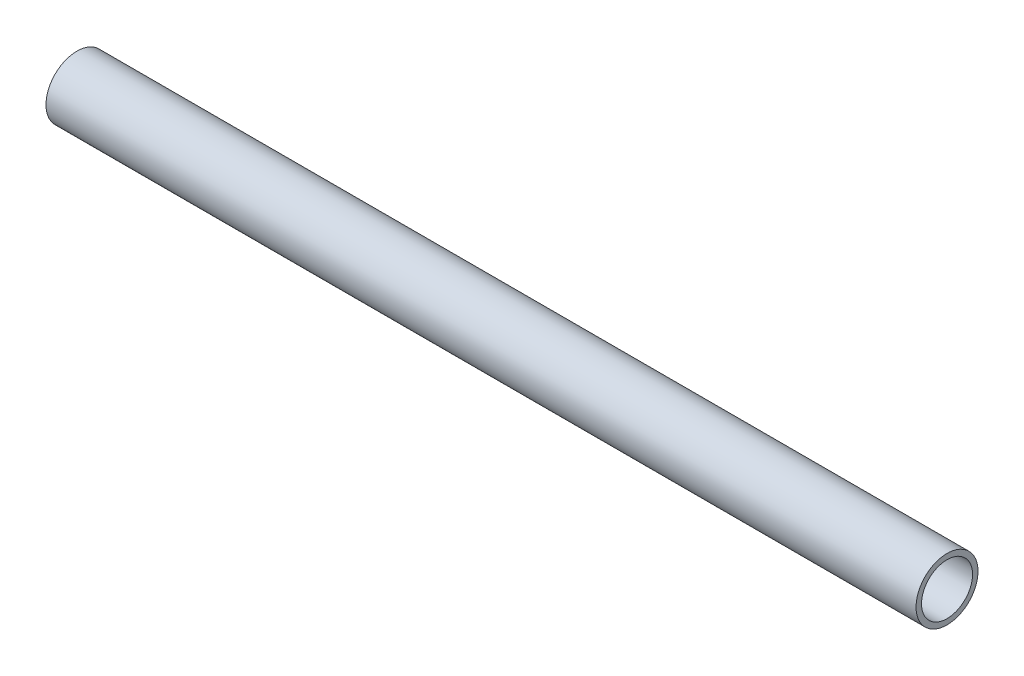
ISO-10303-21;
HEADER;
FILE_DESCRIPTION(('STEP AP214'),'2;1');
FILE_NAME('part.step','',(''),(''),'','','');
FILE_SCHEMA(('AUTOMOTIVE_DESIGN { 1 0 10303 214 1 1 1 1 }'));
ENDSEC;
DATA;
#1=APPLICATION_CONTEXT('core data for automotive mechanical design processes');
#2=APPLICATION_PROTOCOL_DEFINITION('international standard','automotive_design',2000,#1);
#3=PRODUCT_CONTEXT('',#1,'mechanical');
#4=PRODUCT('Part','Part','',(#3));
#5=PRODUCT_RELATED_PRODUCT_CATEGORY('part','',(#4));
#6=PRODUCT_DEFINITION_FORMATION('','',#4);
#7=PRODUCT_DEFINITION_CONTEXT('part definition',#1,'design');
#8=PRODUCT_DEFINITION('design','',#6,#7);
#9=PRODUCT_DEFINITION_SHAPE('','',#8);
#10=(LENGTH_UNIT() NAMED_UNIT(*) SI_UNIT(.MILLI.,.METRE.));
#11=(NAMED_UNIT(*) PLANE_ANGLE_UNIT() SI_UNIT($,.RADIAN.));
#12=(NAMED_UNIT(*) SI_UNIT($,.STERADIAN.) SOLID_ANGLE_UNIT());
#13=UNCERTAINTY_MEASURE_WITH_UNIT(LENGTH_MEASURE(1.E-05),#10,'distance_accuracy_value','');
#14=(GEOMETRIC_REPRESENTATION_CONTEXT(3) GLOBAL_UNCERTAINTY_ASSIGNED_CONTEXT((#13)) GLOBAL_UNIT_ASSIGNED_CONTEXT((#10,
#11,#12)) REPRESENTATION_CONTEXT('',''));
#15=CARTESIAN_POINT('',(0.,0.,0.));
#16=DIRECTION('',(0.,0.,1.));
#17=DIRECTION('',(1.,0.,0.));
#18=AXIS2_PLACEMENT_3D('',#15,#16,#17);
#19=CARTESIAN_POINT('',(-237.645651975997,648.33824962362,0.));
#20=DIRECTION('',(1.,0.,0.));
#21=DIRECTION('',(0.,0.,-1.));
#22=AXIS2_PLACEMENT_3D('',#19,#20,#21);
#23=CYLINDRICAL_SURFACE('',#22,2.6162);
#24=CARTESIAN_POINT('',(-237.645651975997,648.33824962362,0.));
#25=DIRECTION('',(-1.,0.,0.));
#26=DIRECTION('',(0.,-1.,0.));
#27=AXIS2_PLACEMENT_3D('',#24,#25,#26);
#28=CIRCLE('',#27,2.6162);
#29=CARTESIAN_POINT('',(-237.645651975997,645.72204962362,0.));
#30=VERTEX_POINT('',#29);
#31=EDGE_CURVE('E42',#30,#30,#28,.T.);
#32=ORIENTED_EDGE('',*,*,#31,.T.);
#33=EDGE_LOOP('',(#32));
#34=FACE_BOUND('',#33,.T.);
#35=CARTESIAN_POINT('',(-148.488053197196,648.33824962362,0.));
#36=DIRECTION('',(-1.,0.,0.));
#37=DIRECTION('',(0.,-1.,0.));
#38=AXIS2_PLACEMENT_3D('',#35,#36,#37);
#39=CIRCLE('',#38,2.6162);
#40=CARTESIAN_POINT('',(-148.488053197196,645.72204962362,0.));
#41=VERTEX_POINT('',#40);
#42=EDGE_CURVE('E48',#41,#41,#39,.T.);
#43=ORIENTED_EDGE('',*,*,#42,.F.);
#44=EDGE_LOOP('',(#43));
#45=FACE_BOUND('',#44,.T.);
#46=ADVANCED_FACE('F35',(#34,#45),#23,.F.);
#47=CARTESIAN_POINT('',(-237.645651975997,648.33824962362,0.));
#48=DIRECTION('',(1.,0.,0.));
#49=DIRECTION('',(0.,0.,-1.));
#50=AXIS2_PLACEMENT_3D('',#47,#48,#49);
#51=CYLINDRICAL_SURFACE('',#50,3.175);
#52=CARTESIAN_POINT('',(-237.645651975997,648.33824962362,0.));
#53=DIRECTION('',(-1.,0.,0.));
#54=DIRECTION('',(0.,-1.,0.));
#55=AXIS2_PLACEMENT_3D('',#52,#53,#54);
#56=CIRCLE('',#55,3.175);
#57=CARTESIAN_POINT('',(-237.645651975997,645.16324962362,0.));
#58=VERTEX_POINT('',#57);
#59=EDGE_CURVE('E11',#58,#58,#56,.T.);
#60=ORIENTED_EDGE('',*,*,#59,.F.);
#61=EDGE_LOOP('',(#60));
#62=FACE_BOUND('',#61,.T.);
#63=CARTESIAN_POINT('',(-148.488053197196,648.33824962362,0.));
#64=DIRECTION('',(-1.,0.,0.));
#65=DIRECTION('',(0.,-1.,0.));
#66=AXIS2_PLACEMENT_3D('',#63,#64,#65);
#67=CIRCLE('',#66,3.175);
#68=CARTESIAN_POINT('',(-148.488053197196,645.16324962362,0.));
#69=VERTEX_POINT('',#68);
#70=EDGE_CURVE('E38',#69,#69,#67,.T.);
#71=ORIENTED_EDGE('',*,*,#70,.T.);
#72=EDGE_LOOP('',(#71));
#73=FACE_BOUND('',#72,.T.);
#74=ADVANCED_FACE('F55',(#62,#73),#51,.T.);
#75=CARTESIAN_POINT('',(-237.645651975997,648.33824962362,0.));
#76=DIRECTION('',(-1.,0.,0.));
#77=DIRECTION('',(0.,-1.,0.));
#78=AXIS2_PLACEMENT_3D('',#75,#76,#77);
#79=PLANE('',#78);
#80=ORIENTED_EDGE('',*,*,#31,.F.);
#81=EDGE_LOOP('',(#80));
#82=FACE_BOUND('',#81,.T.);
#83=ORIENTED_EDGE('',*,*,#59,.T.);
#84=EDGE_LOOP('',(#83));
#85=FACE_BOUND('',#84,.T.);
#86=ADVANCED_FACE('F59',(#82,#85),#79,.T.);
#87=CARTESIAN_POINT('',(-148.488053197196,648.33824962362,0.));
#88=DIRECTION('',(-1.,0.,0.));
#89=DIRECTION('',(0.,-1.,0.));
#90=AXIS2_PLACEMENT_3D('',#87,#88,#89);
#91=PLANE('',#90);
#92=ORIENTED_EDGE('',*,*,#42,.T.);
#93=EDGE_LOOP('',(#92));
#94=FACE_BOUND('',#93,.T.);
#95=ORIENTED_EDGE('',*,*,#70,.F.);
#96=EDGE_LOOP('',(#95));
#97=FACE_BOUND('',#96,.T.);
#98=ADVANCED_FACE('F57',(#94,#97),#91,.F.);
#99=CLOSED_SHELL('',(#46,#74,#86,#98));
#100=MANIFOLD_SOLID_BREP('B2',#99);
#101=ADVANCED_BREP_SHAPE_REPRESENTATION('',(#18,#100),#14);
#102=SHAPE_DEFINITION_REPRESENTATION(#9,#101);
ENDSEC;
END-ISO-10303-21;
